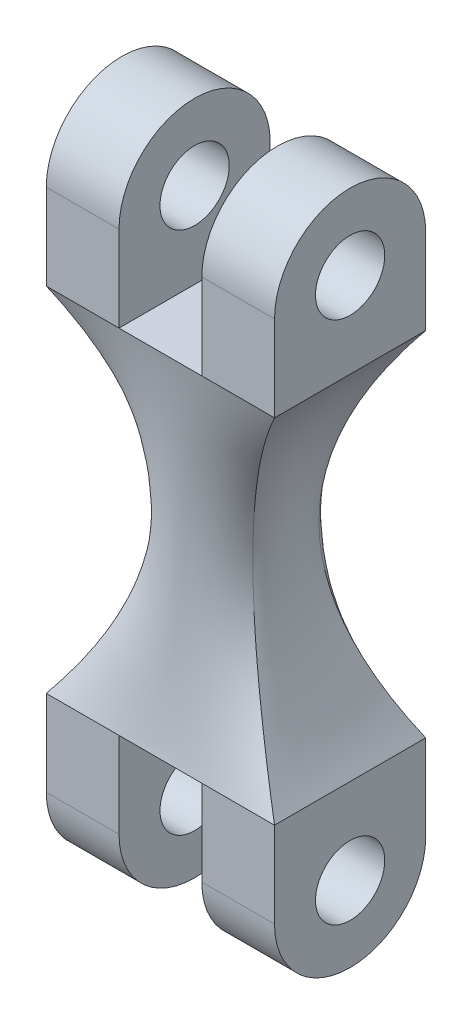
ISO-10303-21;
HEADER;
FILE_DESCRIPTION(('STEP AP214'),'2;1');
FILE_NAME('part.step','',(''),(''),'','','');
FILE_SCHEMA(('AUTOMOTIVE_DESIGN { 1 0 10303 214 1 1 1 1 }'));
ENDSEC;
DATA;
#1=APPLICATION_CONTEXT('core data for automotive mechanical design processes');
#2=APPLICATION_PROTOCOL_DEFINITION('international standard','automotive_design',2000,#1);
#3=PRODUCT_CONTEXT('',#1,'mechanical');
#4=PRODUCT('Part','Part','',(#3));
#5=PRODUCT_RELATED_PRODUCT_CATEGORY('part','',(#4));
#6=PRODUCT_DEFINITION_FORMATION('','',#4);
#7=PRODUCT_DEFINITION_CONTEXT('part definition',#1,'design');
#8=PRODUCT_DEFINITION('design','',#6,#7);
#9=PRODUCT_DEFINITION_SHAPE('','',#8);
#10=(LENGTH_UNIT() NAMED_UNIT(*) SI_UNIT(.MILLI.,.METRE.));
#11=(NAMED_UNIT(*) PLANE_ANGLE_UNIT() SI_UNIT($,.RADIAN.));
#12=(NAMED_UNIT(*) SI_UNIT($,.STERADIAN.) SOLID_ANGLE_UNIT());
#13=UNCERTAINTY_MEASURE_WITH_UNIT(LENGTH_MEASURE(1.E-05),#10,'distance_accuracy_value','');
#14=(GEOMETRIC_REPRESENTATION_CONTEXT(3) GLOBAL_UNCERTAINTY_ASSIGNED_CONTEXT((#13)) GLOBAL_UNIT_ASSIGNED_CONTEXT((#10,
#11,#12)) REPRESENTATION_CONTEXT('',''));
#15=CARTESIAN_POINT('',(0.,0.,0.));
#16=DIRECTION('',(0.,0.,1.));
#17=DIRECTION('',(1.,0.,0.));
#18=AXIS2_PLACEMENT_3D('',#15,#16,#17);
#19=CARTESIAN_POINT('',(0.,0.,0.));
#20=DIRECTION('',(0.,1.,0.));
#21=DIRECTION('',(0.,0.,1.));
#22=AXIS2_PLACEMENT_3D('',#19,#20,#21);
#23=PLANE('',#22);
#24=DIRECTION('',(-1.,0.,0.));
#25=VECTOR('',#24,1.);
#26=CARTESIAN_POINT('',(-4.529,0.,-3.));
#27=LINE('',#26,#25);
#28=CARTESIAN_POINT('',(1.643,0.,-3.));
#29=VERTEX_POINT('',#28);
#30=CARTESIAN_POINT('',(-1.643,0.,-3.));
#31=VERTEX_POINT('',#30);
#32=EDGE_CURVE('E444',#29,#31,#27,.T.);
#33=ORIENTED_EDGE('',*,*,#32,.F.);
#34=DIRECTION('',(0.,0.,1.));
#35=VECTOR('',#34,1.);
#36=CARTESIAN_POINT('',(1.643,0.,3.));
#37=LINE('',#36,#35);
#38=CARTESIAN_POINT('',(1.643,0.,3.));
#39=VERTEX_POINT('',#38);
#40=EDGE_CURVE('E700',#29,#39,#37,.T.);
#41=ORIENTED_EDGE('',*,*,#40,.T.);
#42=DIRECTION('',(1.,0.,0.));
#43=VECTOR('',#42,1.);
#44=CARTESIAN_POINT('',(-4.529,0.,3.));
#45=LINE('',#44,#43);
#46=CARTESIAN_POINT('',(-1.643,0.,3.));
#47=VERTEX_POINT('',#46);
#48=EDGE_CURVE('E331',#47,#39,#45,.T.);
#49=ORIENTED_EDGE('',*,*,#48,.F.);
#50=DIRECTION('',(0.,0.,1.));
#51=VECTOR('',#50,1.);
#52=CARTESIAN_POINT('',(-1.643,0.,3.));
#53=LINE('',#52,#51);
#54=EDGE_CURVE('E389',#31,#47,#53,.T.);
#55=ORIENTED_EDGE('',*,*,#54,.F.);
#56=EDGE_LOOP('',(#33,#41,#49,#55));
#57=FACE_BOUND('',#56,.T.);
#58=ADVANCED_FACE('F77',(#57),#23,.F.);
#59=CARTESIAN_POINT('',(0.,14.,0.));
#60=DIRECTION('',(0.,-1.,0.));
#61=DIRECTION('',(0.,0.,-1.));
#62=AXIS2_PLACEMENT_3D('',#59,#60,#61);
#63=PLANE('',#62);
#64=DIRECTION('',(1.,0.,0.));
#65=VECTOR('',#64,1.);
#66=CARTESIAN_POINT('',(-4.529,14.,3.));
#67=LINE('',#66,#65);
#68=CARTESIAN_POINT('',(-1.643,14.,3.));
#69=VERTEX_POINT('',#68);
#70=CARTESIAN_POINT('',(1.643,14.,3.));
#71=VERTEX_POINT('',#70);
#72=EDGE_CURVE('E87',#69,#71,#67,.T.);
#73=ORIENTED_EDGE('',*,*,#72,.T.);
#74=DIRECTION('',(0.,0.,1.));
#75=VECTOR('',#74,1.);
#76=CARTESIAN_POINT('',(1.643,14.,3.));
#77=LINE('',#76,#75);
#78=CARTESIAN_POINT('',(1.643,14.,-3.));
#79=VERTEX_POINT('',#78);
#80=EDGE_CURVE('E209',#79,#71,#77,.T.);
#81=ORIENTED_EDGE('',*,*,#80,.F.);
#82=DIRECTION('',(-1.,0.,0.));
#83=VECTOR('',#82,1.);
#84=CARTESIAN_POINT('',(-4.529,14.,-3.));
#85=LINE('',#84,#83);
#86=CARTESIAN_POINT('',(-1.643,14.,-3.));
#87=VERTEX_POINT('',#86);
#88=EDGE_CURVE('E324',#79,#87,#85,.T.);
#89=ORIENTED_EDGE('',*,*,#88,.T.);
#90=DIRECTION('',(0.,0.,1.));
#91=VECTOR('',#90,1.);
#92=CARTESIAN_POINT('',(-1.643,14.,3.));
#93=LINE('',#92,#91);
#94=EDGE_CURVE('E246',#87,#69,#93,.T.);
#95=ORIENTED_EDGE('',*,*,#94,.T.);
#96=EDGE_LOOP('',(#73,#81,#89,#95));
#97=FACE_BOUND('',#96,.T.);
#98=ADVANCED_FACE('F79',(#97),#63,.F.);
#99=CARTESIAN_POINT('',(-4.529,0.,3.));
#100=CARTESIAN_POINT('',(-2.82967454845478,2.33333333333333,1.87437042291109));
#101=CARTESIAN_POINT('',(-1.13034909690955,7.,0.748740845822179));
#102=CARTESIAN_POINT('',(-2.82967454845478,11.6666666666667,1.87437042291109));
#103=CARTESIAN_POINT('',(-4.529,14.,3.));
#104=CARTESIAN_POINT('',(-4.15158333333333,0.,3.));
#105=CARTESIAN_POINT('',(-2.62298451265422,2.33333333333333,1.97864445794214));
#106=CARTESIAN_POINT('',(-1.11711278216476,6.99999999999999,0.976482291331089));
#107=CARTESIAN_POINT('',(-2.62298451265422,11.6666666666667,1.97864445794214));
#108=CARTESIAN_POINT('',(-4.15158333333333,14.,3.));
#109=CARTESIAN_POINT('',(-3.39675,0.,3.));
#110=CARTESIAN_POINT('',(-2.20960444105311,2.33333333333334,2.18719252800423));
#111=CARTESIAN_POINT('',(-1.01223163115228,7.00000000000002,1.36566080837681));
#112=CARTESIAN_POINT('',(-2.20960444105311,11.6666666666667,2.18719252800423));
#113=CARTESIAN_POINT('',(-3.39675,14.,3.));
#114=CARTESIAN_POINT('',(-1.88708333333333,0.,3.));
#115=CARTESIAN_POINT('',(-1.27993394314497,2.33333333333333,2.48170910900993));
#116=CARTESIAN_POINT('',(-0.678466627347055,6.99999999999998,1.96865270528451));
#117=CARTESIAN_POINT('',(-1.27993394314497,11.6666666666667,2.48170910900993));
#118=CARTESIAN_POINT('',(-1.88708333333333,14.,3.));
#119=CARTESIAN_POINT('',(0.,0.,3.));
#120=CARTESIAN_POINT('',(8.36980925779145E-05,2.33333333333334,2.65150795100174));
#121=CARTESIAN_POINT('',(0.000169810929422209,7.00000000000002,2.29952675477991));
#122=CARTESIAN_POINT('',(8.36980925769723E-05,11.6666666666667,2.65150795100173));
#123=CARTESIAN_POINT('',(0.,14.,3.));
#124=CARTESIAN_POINT('',(1.88708333333333,0.,3.));
#125=CARTESIAN_POINT('',(1.27977178462595,2.33333333333333,2.48175153838506));
#126=CARTESIAN_POINT('',(0.678135066076207,6.99999999999999,1.96873603117617));
#127=CARTESIAN_POINT('',(1.27977178462595,11.6666666666667,2.48175153838506));
#128=CARTESIAN_POINT('',(1.88708333333333,14.,3.));
#129=CARTESIAN_POINT('',(3.39675,0.,3.));
#130=CARTESIAN_POINT('',(2.20963100324003,2.33333333333333,2.18719865943864));
#131=CARTESIAN_POINT('',(1.01229682924744,7.,1.36567583039112));
#132=CARTESIAN_POINT('',(2.20963100324003,11.6666666666667,2.18719865943864));
#133=CARTESIAN_POINT('',(3.39675,14.,3.));
#134=CARTESIAN_POINT('',(4.15158333333333,0.,3.));
#135=CARTESIAN_POINT('',(2.62299336671653,2.33333333333333,1.97864650175361));
#136=CARTESIAN_POINT('',(1.11710392810245,7.,0.976480247519621));
#137=CARTESIAN_POINT('',(2.62299336671652,11.6666666666667,1.97864650175361));
#138=CARTESIAN_POINT('',(4.15158333333333,14.,3.));
#139=CARTESIAN_POINT('',(4.529,0.,3.));
#140=CARTESIAN_POINT('',(2.82967454845477,2.33333333333333,1.87437042291109));
#141=CARTESIAN_POINT('',(1.13034909690955,7.,0.748740845822179));
#142=CARTESIAN_POINT('',(2.82967454845477,11.6666666666667,1.87437042291109));
#143=CARTESIAN_POINT('',(4.529,14.,3.));
#144=B_SPLINE_SURFACE_WITH_KNOTS('',3,3,((#99,#100,#101,#102,#103),(#104,#105,#106,#107,#108),
(#109,#110,#111,#112,#113),(#114,#115,#116,#117,#118),(#119,#120,#121,#122,#123),(#124,#125,
#126,#127,#128),(#129,#130,#131,#132,#133),(#134,#135,#136,#137,#138),(#139,#140,#141,#142,
#143)),.UNSPECIFIED.,.F.,.F.,.F.,(4,1,1,1,1,1,4),(4,1,4),(0.,0.125,0.25,0.5,0.75,0.875,1.),(0.,
0.5,1.),.UNSPECIFIED.);
#145=CARTESIAN_POINT('',(-4.529,0.,3.));
#146=VERTEX_POINT('',#145);
#147=EDGE_CURVE('E445',#146,#47,#45,.T.);
#148=DIRECTION('',(1.,0.,0.));
#149=VECTOR('',#148,1.);
#150=CARTESIAN_POINT('',(1.643,0.,3.));
#151=LINE('',#150,#149);
#152=CARTESIAN_POINT('',(4.529,0.,3.));
#153=VERTEX_POINT('',#152);
#154=EDGE_CURVE('E527',#39,#153,#151,.T.);
#155=CARTESIAN_POINT('',(4.529,0.,3.));
#156=CARTESIAN_POINT('',(2.82967454845477,2.33333333333333,1.87437042291109));
#157=CARTESIAN_POINT('',(1.13034909690955,7.,0.748740845822179));
#158=CARTESIAN_POINT('',(2.82967454845477,11.6666666666667,1.87437042291109));
#159=CARTESIAN_POINT('',(4.529,14.,3.));
#160=B_SPLINE_CURVE_WITH_KNOTS('',3,(#155,#156,#157,#158,#159),.UNSPECIFIED.,.F.,.F.,(4,1,4),
(0.,0.5,1.),.UNSPECIFIED.);
#161=CARTESIAN_POINT('',(4.529,14.,3.));
#162=VERTEX_POINT('',#161);
#163=EDGE_CURVE('E536',#153,#162,#160,.T.);
#164=DIRECTION('',(1.,0.,0.));
#165=VECTOR('',#164,1.);
#166=CARTESIAN_POINT('',(1.643,14.,3.));
#167=LINE('',#166,#165);
#168=EDGE_CURVE('E95',#71,#162,#167,.T.);
#169=CARTESIAN_POINT('',(-4.529,14.,3.));
#170=VERTEX_POINT('',#169);
#171=EDGE_CURVE('E12',#170,#69,#67,.T.);
#172=CARTESIAN_POINT('',(-4.529,0.,3.));
#173=CARTESIAN_POINT('',(-2.82967454845478,2.33333333333333,1.87437042291109));
#174=CARTESIAN_POINT('',(-1.13034909690955,7.,0.748740845822179));
#175=CARTESIAN_POINT('',(-2.82967454845478,11.6666666666667,1.87437042291109));
#176=CARTESIAN_POINT('',(-4.529,14.,3.));
#177=B_SPLINE_CURVE_WITH_KNOTS('',3,(#172,#173,#174,#175,#176),.UNSPECIFIED.,.F.,.F.,(4,1,4),
(0.,0.5,1.),.UNSPECIFIED.);
#178=EDGE_CURVE('E617',#170,#146,#177,.F.);
#179=ORIENTED_EDGE('',*,*,#147,.T.);
#180=ORIENTED_EDGE('',*,*,#48,.T.);
#181=ORIENTED_EDGE('',*,*,#154,.T.);
#182=ORIENTED_EDGE('',*,*,#163,.T.);
#183=ORIENTED_EDGE('',*,*,#168,.F.);
#184=ORIENTED_EDGE('',*,*,#72,.F.);
#185=ORIENTED_EDGE('',*,*,#171,.F.);
#186=ORIENTED_EDGE('',*,*,#178,.T.);
#187=EDGE_LOOP('',(#179,#180,#181,#182,#183,#184,#185,#186));
#188=FACE_BOUND('',#187,.T.);
#189=ADVANCED_FACE('F505',(#188),#144,.T.);
#190=CARTESIAN_POINT('',(4.529,0.,3.));
#191=CARTESIAN_POINT('',(2.82967454845478,2.33333333333333,1.87437042291109));
#192=CARTESIAN_POINT('',(1.13034909690955,7.,0.748740845822178));
#193=CARTESIAN_POINT('',(2.82967454845477,11.6666666666667,1.87437042291109));
#194=CARTESIAN_POINT('',(4.529,14.,3.));
#195=CARTESIAN_POINT('',(4.529,0.,1.));
#196=CARTESIAN_POINT('',(2.82967454845477,2.33333333333333,0.624790140970363));
#197=CARTESIAN_POINT('',(2.18342179018679,7.,0.40853238514536));
#198=CARTESIAN_POINT('',(2.82967454845477,11.6666666666667,0.624790140970363));
#199=CARTESIAN_POINT('',(4.529,14.,1.));
#200=CARTESIAN_POINT('',(4.529,0.,-1.));
#201=CARTESIAN_POINT('',(2.82967454845477,2.33333333333333,-0.624790140970363));
#202=CARTESIAN_POINT('',(2.18342179018679,7.,-0.40853238514536));
#203=CARTESIAN_POINT('',(2.82967454845477,11.6666666666667,-0.624790140970363));
#204=CARTESIAN_POINT('',(4.529,14.,-1.));
#205=CARTESIAN_POINT('',(4.529,0.,-3.));
#206=CARTESIAN_POINT('',(2.82967454845477,2.33333333333333,-1.87437042291109));
#207=CARTESIAN_POINT('',(1.13034909690955,7.,-0.748740845822179));
#208=CARTESIAN_POINT('',(2.82967454845478,11.6666666666667,-1.87437042291109));
#209=CARTESIAN_POINT('',(4.529,14.,-3.));
#210=B_SPLINE_SURFACE_WITH_KNOTS('',3,3,((#190,#191,#192,#193,#194),(#195,#196,#197,#198,#199),
(#200,#201,#202,#203,#204),(#205,#206,#207,#208,#209)),.UNSPECIFIED.,.F.,.F.,.F.,(4,4),(4,1,4),
(0.,1.),(0.,0.5,1.),.UNSPECIFIED.);
#211=DIRECTION('',(0.,0.,-1.));
#212=VECTOR('',#211,1.);
#213=CARTESIAN_POINT('',(4.529,0.,-3.));
#214=LINE('',#213,#212);
#215=CARTESIAN_POINT('',(4.529,0.,-3.));
#216=VERTEX_POINT('',#215);
#217=EDGE_CURVE('E410',#153,#216,#214,.T.);
#218=CARTESIAN_POINT('',(4.529,0.,-3.));
#219=CARTESIAN_POINT('',(2.82967454845477,2.33333333333333,-1.87437042291109));
#220=CARTESIAN_POINT('',(1.13034909690955,7.,-0.748740845822179));
#221=CARTESIAN_POINT('',(2.82967454845478,11.6666666666667,-1.87437042291109));
#222=CARTESIAN_POINT('',(4.529,14.,-3.));
#223=B_SPLINE_CURVE_WITH_KNOTS('',3,(#218,#219,#220,#221,#222),.UNSPECIFIED.,.F.,.F.,(4,1,4),
(0.,0.5,1.),.UNSPECIFIED.);
#224=CARTESIAN_POINT('',(4.529,14.,-3.));
#225=VERTEX_POINT('',#224);
#226=EDGE_CURVE('E371',#216,#225,#223,.T.);
#227=DIRECTION('',(0.,0.,-1.));
#228=VECTOR('',#227,1.);
#229=CARTESIAN_POINT('',(4.529,14.,3.));
#230=LINE('',#229,#228);
#231=EDGE_CURVE('E576',#162,#225,#230,.T.);
#232=ORIENTED_EDGE('',*,*,#217,.T.);
#233=ORIENTED_EDGE('',*,*,#226,.T.);
#234=ORIENTED_EDGE('',*,*,#231,.F.);
#235=ORIENTED_EDGE('',*,*,#163,.F.);
#236=EDGE_LOOP('',(#232,#233,#234,#235));
#237=FACE_BOUND('',#236,.T.);
#238=ADVANCED_FACE('F579',(#237),#210,.T.);
#239=CARTESIAN_POINT('',(-4.529,0.,-3.));
#240=CARTESIAN_POINT('',(-2.82967454845478,2.33333333333333,-1.87437042291109));
#241=CARTESIAN_POINT('',(-1.13034909690955,7.,-0.748740845822179));
#242=CARTESIAN_POINT('',(-2.82967454845477,11.6666666666667,-1.87437042291109));
#243=CARTESIAN_POINT('',(-4.529,14.,-3.));
#244=CARTESIAN_POINT('',(-4.529,0.,-1.));
#245=CARTESIAN_POINT('',(-2.82967454845477,2.33333333333333,-0.624790140970363));
#246=CARTESIAN_POINT('',(-2.18342179018679,7.,-0.40853238514536));
#247=CARTESIAN_POINT('',(-2.82967454845477,11.6666666666667,-0.624790140970363));
#248=CARTESIAN_POINT('',(-4.529,14.,-1.));
#249=CARTESIAN_POINT('',(-4.529,0.,1.));
#250=CARTESIAN_POINT('',(-2.82967454845477,2.33333333333333,0.624790140970363));
#251=CARTESIAN_POINT('',(-2.18342179018679,7.,0.408532385145359));
#252=CARTESIAN_POINT('',(-2.82967454845477,11.6666666666667,0.624790140970363));
#253=CARTESIAN_POINT('',(-4.529,14.,1.));
#254=CARTESIAN_POINT('',(-4.529,0.,3.));
#255=CARTESIAN_POINT('',(-2.82967454845477,2.33333333333333,1.87437042291109));
#256=CARTESIAN_POINT('',(-1.13034909690955,7.,0.748740845822178));
#257=CARTESIAN_POINT('',(-2.82967454845478,11.6666666666667,1.87437042291109));
#258=CARTESIAN_POINT('',(-4.529,14.,3.));
#259=B_SPLINE_SURFACE_WITH_KNOTS('',3,3,((#239,#240,#241,#242,#243),(#244,#245,#246,#247,#248),
(#249,#250,#251,#252,#253),(#254,#255,#256,#257,#258)),.UNSPECIFIED.,.F.,.F.,.F.,(4,4),(4,1,4),
(0.,1.),(0.,0.5,1.),.UNSPECIFIED.);
#260=DIRECTION('',(0.,0.,1.));
#261=VECTOR('',#260,1.);
#262=CARTESIAN_POINT('',(-4.529,0.,-3.));
#263=LINE('',#262,#261);
#264=CARTESIAN_POINT('',(-4.529,0.,-3.));
#265=VERTEX_POINT('',#264);
#266=EDGE_CURVE('E437',#265,#146,#263,.T.);
#267=DIRECTION('',(0.,0.,1.));
#268=VECTOR('',#267,1.);
#269=CARTESIAN_POINT('',(-4.529,14.,3.));
#270=LINE('',#269,#268);
#271=CARTESIAN_POINT('',(-4.529,14.,-3.));
#272=VERTEX_POINT('',#271);
#273=EDGE_CURVE('E273',#272,#170,#270,.T.);
#274=CARTESIAN_POINT('',(-4.529,0.,-3.));
#275=CARTESIAN_POINT('',(-2.82967454845478,2.33333333333333,-1.87437042291109));
#276=CARTESIAN_POINT('',(-1.13034909690955,7.,-0.748740845822178));
#277=CARTESIAN_POINT('',(-2.82967454845478,11.6666666666667,-1.87437042291109));
#278=CARTESIAN_POINT('',(-4.529,14.,-3.));
#279=B_SPLINE_CURVE_WITH_KNOTS('',3,(#274,#275,#276,#277,#278),.UNSPECIFIED.,.F.,.F.,(4,1,4),
(0.,0.5,1.),.UNSPECIFIED.);
#280=EDGE_CURVE('E328',#265,#272,#279,.T.);
#281=ORIENTED_EDGE('',*,*,#266,.T.);
#282=ORIENTED_EDGE('',*,*,#178,.F.);
#283=ORIENTED_EDGE('',*,*,#273,.F.);
#284=ORIENTED_EDGE('',*,*,#280,.F.);
#285=EDGE_LOOP('',(#281,#282,#283,#284));
#286=FACE_BOUND('',#285,.T.);
#287=ADVANCED_FACE('F354',(#286),#259,.T.);
#288=CARTESIAN_POINT('',(4.529,0.,-3.));
#289=CARTESIAN_POINT('',(2.82967454845477,2.33333333333333,-1.87437042291109));
#290=CARTESIAN_POINT('',(1.13034909690955,7.,-0.748740845822179));
#291=CARTESIAN_POINT('',(2.82967454845478,11.6666666666667,-1.87437042291109));
#292=CARTESIAN_POINT('',(4.529,14.,-3.));
#293=CARTESIAN_POINT('',(4.15158333333333,0.,-3.));
#294=CARTESIAN_POINT('',(2.62298451265422,2.33333333333333,-1.97864445794214));
#295=CARTESIAN_POINT('',(1.11711278216476,7.,-0.97648229133109));
#296=CARTESIAN_POINT('',(2.62298451265422,11.6666666666667,-1.97864445794214));
#297=CARTESIAN_POINT('',(4.15158333333333,14.,-3.));
#298=CARTESIAN_POINT('',(3.39675,0.,-3.));
#299=CARTESIAN_POINT('',(2.20960444105311,2.33333333333333,-2.18719252800423));
#300=CARTESIAN_POINT('',(1.01223163115228,7.,-1.36566080837681));
#301=CARTESIAN_POINT('',(2.20960444105312,11.6666666666667,-2.18719252800423));
#302=CARTESIAN_POINT('',(3.39675,14.,-3.));
#303=CARTESIAN_POINT('',(1.88708333333333,0.,-3.));
#304=CARTESIAN_POINT('',(1.27993394314497,2.33333333333333,-2.48170910900993));
#305=CARTESIAN_POINT('',(0.678466627347055,7.,-1.96865270528451));
#306=CARTESIAN_POINT('',(1.27993394314497,11.6666666666667,-2.48170910900993));
#307=CARTESIAN_POINT('',(1.88708333333333,14.,-3.));
#308=CARTESIAN_POINT('',(0.,0.,-3.));
#309=CARTESIAN_POINT('',(-8.36980925789987E-05,2.33333333333333,-2.65150795100174));
#310=CARTESIAN_POINT('',(-0.000169810929420441,7.,-2.29952675477991));
#311=CARTESIAN_POINT('',(-8.36980925750879E-05,11.6666666666667,-2.65150795100174));
#312=CARTESIAN_POINT('',(0.,14.,-3.));
#313=CARTESIAN_POINT('',(-1.88708333333333,0.,-3.));
#314=CARTESIAN_POINT('',(-1.27977178462594,2.33333333333333,-2.48175153838506));
#315=CARTESIAN_POINT('',(-0.678135066076209,7.,-1.96873603117617));
#316=CARTESIAN_POINT('',(-1.27977178462595,11.6666666666667,-2.48175153838506));
#317=CARTESIAN_POINT('',(-1.88708333333333,14.,-3.));
#318=CARTESIAN_POINT('',(-3.39675,0.,-3.));
#319=CARTESIAN_POINT('',(-2.20963100324003,2.33333333333333,-2.18719865943864));
#320=CARTESIAN_POINT('',(-1.01229682924744,6.99999999999999,-1.36567583039112));
#321=CARTESIAN_POINT('',(-2.20963100324003,11.6666666666667,-2.18719865943864));
#322=CARTESIAN_POINT('',(-3.39675,14.,-3.));
#323=CARTESIAN_POINT('',(-4.15158333333333,0.,-3.));
#324=CARTESIAN_POINT('',(-2.62299336671653,2.33333333333333,-1.97864650175361));
#325=CARTESIAN_POINT('',(-1.11710392810245,7.,-0.976480247519619));
#326=CARTESIAN_POINT('',(-2.62299336671653,11.6666666666667,-1.97864650175361));
#327=CARTESIAN_POINT('',(-4.15158333333333,14.,-3.));
#328=CARTESIAN_POINT('',(-4.529,0.,-3.));
#329=CARTESIAN_POINT('',(-2.82967454845478,2.33333333333333,-1.87437042291109));
#330=CARTESIAN_POINT('',(-1.13034909690955,7.,-0.748740845822178));
#331=CARTESIAN_POINT('',(-2.82967454845478,11.6666666666667,-1.87437042291109));
#332=CARTESIAN_POINT('',(-4.529,14.,-3.));
#333=B_SPLINE_SURFACE_WITH_KNOTS('',3,3,((#288,#289,#290,#291,#292),(#293,#294,#295,#296,#297),
(#298,#299,#300,#301,#302),(#303,#304,#305,#306,#307),(#308,#309,#310,#311,#312),(#313,#314,
#315,#316,#317),(#318,#319,#320,#321,#322),(#323,#324,#325,#326,#327),(#328,#329,#330,#331,
#332)),.UNSPECIFIED.,.F.,.F.,.F.,(4,1,1,1,1,1,4),(4,1,4),(0.,0.125,0.25,0.5,0.75,0.875,1.),(0.,
0.5,1.),.UNSPECIFIED.);
#334=EDGE_CURVE('E615',#216,#29,#27,.T.);
#335=DIRECTION('',(-1.,0.,0.));
#336=VECTOR('',#335,1.);
#337=CARTESIAN_POINT('',(-1.643,0.,-3.));
#338=LINE('',#337,#336);
#339=EDGE_CURVE('E385',#31,#265,#338,.T.);
#340=DIRECTION('',(-1.,0.,0.));
#341=VECTOR('',#340,1.);
#342=CARTESIAN_POINT('',(-1.643,14.,-3.));
#343=LINE('',#342,#341);
#344=EDGE_CURVE('E260',#87,#272,#343,.T.);
#345=EDGE_CURVE('E205',#225,#79,#85,.T.);
#346=ORIENTED_EDGE('',*,*,#334,.T.);
#347=ORIENTED_EDGE('',*,*,#32,.T.);
#348=ORIENTED_EDGE('',*,*,#339,.T.);
#349=ORIENTED_EDGE('',*,*,#280,.T.);
#350=ORIENTED_EDGE('',*,*,#344,.F.);
#351=ORIENTED_EDGE('',*,*,#88,.F.);
#352=ORIENTED_EDGE('',*,*,#345,.F.);
#353=ORIENTED_EDGE('',*,*,#226,.F.);
#354=EDGE_LOOP('',(#346,#347,#348,#349,#350,#351,#352,#353));
#355=FACE_BOUND('',#354,.T.);
#356=ADVANCED_FACE('F323',(#355),#333,.T.);
#357=CARTESIAN_POINT('',(-1.643,-3.4,0.));
#358=DIRECTION('',(1.,0.,0.));
#359=DIRECTION('',(0.,0.,-1.));
#360=AXIS2_PLACEMENT_3D('',#357,#358,#359);
#361=PLANE('',#360);
#362=CARTESIAN_POINT('',(-1.643,-3.4,0.));
#363=DIRECTION('',(1.,0.,0.));
#364=DIRECTION('',(0.,0.,-1.));
#365=AXIS2_PLACEMENT_3D('',#362,#363,#364);
#366=CIRCLE('',#365,3.);
#367=CARTESIAN_POINT('',(-1.643,-3.4,3.));
#368=VERTEX_POINT('',#367);
#369=CARTESIAN_POINT('',(-1.643,-3.4,-3.));
#370=VERTEX_POINT('',#369);
#371=EDGE_CURVE('E399',#368,#370,#366,.T.);
#372=ORIENTED_EDGE('',*,*,#371,.T.);
#373=DIRECTION('',(0.,1.,0.));
#374=VECTOR('',#373,1.);
#375=CARTESIAN_POINT('',(-1.643,-3.4,-3.));
#376=LINE('',#375,#374);
#377=EDGE_CURVE('E394',#370,#31,#376,.T.);
#378=ORIENTED_EDGE('',*,*,#377,.T.);
#379=ORIENTED_EDGE('',*,*,#54,.T.);
#380=DIRECTION('',(0.,-1.,0.));
#381=VECTOR('',#380,1.);
#382=CARTESIAN_POINT('',(-1.643,-3.4,3.));
#383=LINE('',#382,#381);
#384=EDGE_CURVE('E393',#47,#368,#383,.T.);
#385=ORIENTED_EDGE('',*,*,#384,.T.);
#386=EDGE_LOOP('',(#372,#378,#379,#385));
#387=FACE_BOUND('',#386,.T.);
#388=CARTESIAN_POINT('',(-1.643,-3.4,0.));
#389=DIRECTION('',(1.,0.,0.));
#390=DIRECTION('',(0.,0.,-1.));
#391=AXIS2_PLACEMENT_3D('',#388,#389,#390);
#392=CIRCLE('',#391,1.375);
#393=CARTESIAN_POINT('',(-1.643,-3.4,-1.375));
#394=VERTEX_POINT('',#393);
#395=EDGE_CURVE('E405',#394,#394,#392,.T.);
#396=ORIENTED_EDGE('',*,*,#395,.F.);
#397=EDGE_LOOP('',(#396));
#398=FACE_BOUND('',#397,.T.);
#399=ADVANCED_FACE('F353',(#387,#398),#361,.T.);
#400=CARTESIAN_POINT('',(-4.529,-3.4,0.));
#401=DIRECTION('',(1.,0.,0.));
#402=DIRECTION('',(0.,0.,-1.));
#403=AXIS2_PLACEMENT_3D('',#400,#401,#402);
#404=PLANE('',#403);
#405=CARTESIAN_POINT('',(-4.529,-3.4,0.));
#406=DIRECTION('',(1.,0.,0.));
#407=DIRECTION('',(0.,0.,-1.));
#408=AXIS2_PLACEMENT_3D('',#405,#406,#407);
#409=CIRCLE('',#408,3.);
#410=CARTESIAN_POINT('',(-4.529,-3.4,3.));
#411=VERTEX_POINT('',#410);
#412=CARTESIAN_POINT('',(-4.529,-3.4,-3.));
#413=VERTEX_POINT('',#412);
#414=EDGE_CURVE('E401',#411,#413,#409,.T.);
#415=ORIENTED_EDGE('',*,*,#414,.F.);
#416=DIRECTION('',(0.,-1.,0.));
#417=VECTOR('',#416,1.);
#418=CARTESIAN_POINT('',(-4.529,-3.4,3.));
#419=LINE('',#418,#417);
#420=EDGE_CURVE('E435',#146,#411,#419,.T.);
#421=ORIENTED_EDGE('',*,*,#420,.F.);
#422=ORIENTED_EDGE('',*,*,#266,.F.);
#423=DIRECTION('',(0.,1.,0.));
#424=VECTOR('',#423,1.);
#425=CARTESIAN_POINT('',(-4.529,-3.4,-3.));
#426=LINE('',#425,#424);
#427=EDGE_CURVE('E404',#413,#265,#426,.T.);
#428=ORIENTED_EDGE('',*,*,#427,.F.);
#429=EDGE_LOOP('',(#415,#421,#422,#428));
#430=FACE_BOUND('',#429,.T.);
#431=CARTESIAN_POINT('',(-4.529,-3.4,0.));
#432=DIRECTION('',(1.,0.,0.));
#433=DIRECTION('',(0.,0.,-1.));
#434=AXIS2_PLACEMENT_3D('',#431,#432,#433);
#435=CIRCLE('',#434,1.375);
#436=CARTESIAN_POINT('',(-4.529,-3.4,-1.375));
#437=VERTEX_POINT('',#436);
#438=EDGE_CURVE('E726',#437,#437,#435,.T.);
#439=ORIENTED_EDGE('',*,*,#438,.T.);
#440=EDGE_LOOP('',(#439));
#441=FACE_BOUND('',#440,.T.);
#442=ADVANCED_FACE('F439',(#430,#441),#404,.F.);
#443=CARTESIAN_POINT('',(-1.643,-3.4,0.));
#444=DIRECTION('',(-1.,0.,0.));
#445=DIRECTION('',(0.,0.,1.));
#446=AXIS2_PLACEMENT_3D('',#443,#444,#445);
#447=CYLINDRICAL_SURFACE('',#446,3.);
#448=ORIENTED_EDGE('',*,*,#414,.T.);
#449=DIRECTION('',(-1.,0.,0.));
#450=VECTOR('',#449,1.);
#451=CARTESIAN_POINT('',(-1.643,-3.4,-3.));
#452=LINE('',#451,#450);
#453=EDGE_CURVE('E408',#370,#413,#452,.T.);
#454=ORIENTED_EDGE('',*,*,#453,.F.);
#455=ORIENTED_EDGE('',*,*,#371,.F.);
#456=DIRECTION('',(-1.,0.,0.));
#457=VECTOR('',#456,1.);
#458=CARTESIAN_POINT('',(-1.643,-3.4,3.));
#459=LINE('',#458,#457);
#460=EDGE_CURVE('E406',#368,#411,#459,.T.);
#461=ORIENTED_EDGE('',*,*,#460,.T.);
#462=EDGE_LOOP('',(#448,#454,#455,#461));
#463=FACE_BOUND('',#462,.T.);
#464=ADVANCED_FACE('F463',(#463),#447,.T.);
#465=CARTESIAN_POINT('',(-1.643,-3.4,-3.));
#466=DIRECTION('',(0.,0.,1.));
#467=DIRECTION('',(1.,0.,0.));
#468=AXIS2_PLACEMENT_3D('',#465,#466,#467);
#469=PLANE('',#468);
#470=ORIENTED_EDGE('',*,*,#427,.T.);
#471=ORIENTED_EDGE('',*,*,#339,.F.);
#472=ORIENTED_EDGE('',*,*,#377,.F.);
#473=ORIENTED_EDGE('',*,*,#453,.T.);
#474=EDGE_LOOP('',(#470,#471,#472,#473));
#475=FACE_BOUND('',#474,.T.);
#476=ADVANCED_FACE('F429',(#475),#469,.F.);
#477=CARTESIAN_POINT('',(-1.643,-3.4,3.));
#478=DIRECTION('',(0.,0.,-1.));
#479=DIRECTION('',(0.,1.,0.));
#480=AXIS2_PLACEMENT_3D('',#477,#478,#479);
#481=PLANE('',#480);
#482=ORIENTED_EDGE('',*,*,#420,.T.);
#483=ORIENTED_EDGE('',*,*,#460,.F.);
#484=ORIENTED_EDGE('',*,*,#384,.F.);
#485=ORIENTED_EDGE('',*,*,#147,.F.);
#486=EDGE_LOOP('',(#482,#483,#484,#485));
#487=FACE_BOUND('',#486,.T.);
#488=ADVANCED_FACE('F465',(#487),#481,.F.);
#489=CARTESIAN_POINT('',(-1.643,-3.4,0.));
#490=DIRECTION('',(-1.,0.,0.));
#491=DIRECTION('',(0.,0.,1.));
#492=AXIS2_PLACEMENT_3D('',#489,#490,#491);
#493=CYLINDRICAL_SURFACE('',#492,1.375);
#494=ORIENTED_EDGE('',*,*,#395,.T.);
#495=EDGE_LOOP('',(#494));
#496=FACE_BOUND('',#495,.T.);
#497=ORIENTED_EDGE('',*,*,#438,.F.);
#498=EDGE_LOOP('',(#497));
#499=FACE_BOUND('',#498,.T.);
#500=ADVANCED_FACE('F468',(#496,#499),#493,.F.);
#501=CARTESIAN_POINT('',(1.643,-3.4,0.));
#502=DIRECTION('',(1.,0.,0.));
#503=DIRECTION('',(0.,0.,-1.));
#504=AXIS2_PLACEMENT_3D('',#501,#502,#503);
#505=CYLINDRICAL_SURFACE('',#504,3.);
#506=CARTESIAN_POINT('',(4.529,-3.4,0.));
#507=DIRECTION('',(1.,0.,0.));
#508=DIRECTION('',(0.,0.,-1.));
#509=AXIS2_PLACEMENT_3D('',#506,#507,#508);
#510=CIRCLE('',#509,3.);
#511=CARTESIAN_POINT('',(4.529,-3.4,3.));
#512=VERTEX_POINT('',#511);
#513=CARTESIAN_POINT('',(4.529,-3.4,-3.));
#514=VERTEX_POINT('',#513);
#515=EDGE_CURVE('E712',#512,#514,#510,.T.);
#516=ORIENTED_EDGE('',*,*,#515,.F.);
#517=DIRECTION('',(1.,0.,0.));
#518=VECTOR('',#517,1.);
#519=CARTESIAN_POINT('',(1.643,-3.4,3.));
#520=LINE('',#519,#518);
#521=CARTESIAN_POINT('',(1.643,-3.4,3.));
#522=VERTEX_POINT('',#521);
#523=EDGE_CURVE('E704',#522,#512,#520,.T.);
#524=ORIENTED_EDGE('',*,*,#523,.F.);
#525=CARTESIAN_POINT('',(1.643,-3.4,0.));
#526=DIRECTION('',(1.,0.,0.));
#527=DIRECTION('',(0.,0.,-1.));
#528=AXIS2_PLACEMENT_3D('',#525,#526,#527);
#529=CIRCLE('',#528,3.);
#530=CARTESIAN_POINT('',(1.643,-3.4,-3.));
#531=VERTEX_POINT('',#530);
#532=EDGE_CURVE('E701',#522,#531,#529,.T.);
#533=ORIENTED_EDGE('',*,*,#532,.T.);
#534=DIRECTION('',(1.,0.,0.));
#535=VECTOR('',#534,1.);
#536=CARTESIAN_POINT('',(1.643,-3.4,-3.));
#537=LINE('',#536,#535);
#538=EDGE_CURVE('E705',#531,#514,#537,.T.);
#539=ORIENTED_EDGE('',*,*,#538,.T.);
#540=EDGE_LOOP('',(#516,#524,#533,#539));
#541=FACE_BOUND('',#540,.T.);
#542=ADVANCED_FACE('F685',(#541),#505,.T.);
#543=CARTESIAN_POINT('',(1.643,-3.4,3.));
#544=DIRECTION('',(0.,0.,1.));
#545=DIRECTION('',(0.,-1.,0.));
#546=AXIS2_PLACEMENT_3D('',#543,#544,#545);
#547=PLANE('',#546);
#548=DIRECTION('',(0.,-1.,0.));
#549=VECTOR('',#548,1.);
#550=CARTESIAN_POINT('',(4.529,-3.4,3.));
#551=LINE('',#550,#549);
#552=EDGE_CURVE('E710',#153,#512,#551,.T.);
#553=ORIENTED_EDGE('',*,*,#552,.F.);
#554=ORIENTED_EDGE('',*,*,#154,.F.);
#555=DIRECTION('',(0.,-1.,0.));
#556=VECTOR('',#555,1.);
#557=CARTESIAN_POINT('',(1.643,-3.4,3.));
#558=LINE('',#557,#556);
#559=EDGE_CURVE('E692',#39,#522,#558,.T.);
#560=ORIENTED_EDGE('',*,*,#559,.T.);
#561=ORIENTED_EDGE('',*,*,#523,.T.);
#562=EDGE_LOOP('',(#553,#554,#560,#561));
#563=FACE_BOUND('',#562,.T.);
#564=ADVANCED_FACE('F678',(#563),#547,.T.);
#565=CARTESIAN_POINT('',(1.643,-3.4,-3.));
#566=DIRECTION('',(0.,0.,-1.));
#567=DIRECTION('',(-1.,0.,0.));
#568=AXIS2_PLACEMENT_3D('',#565,#566,#567);
#569=PLANE('',#568);
#570=DIRECTION('',(0.,1.,0.));
#571=VECTOR('',#570,1.);
#572=CARTESIAN_POINT('',(4.529,-3.4,-3.));
#573=LINE('',#572,#571);
#574=EDGE_CURVE('E666',#514,#216,#573,.T.);
#575=ORIENTED_EDGE('',*,*,#574,.F.);
#576=ORIENTED_EDGE('',*,*,#538,.F.);
#577=DIRECTION('',(0.,1.,0.));
#578=VECTOR('',#577,1.);
#579=CARTESIAN_POINT('',(1.643,-3.4,-3.));
#580=LINE('',#579,#578);
#581=EDGE_CURVE('E529',#531,#29,#580,.T.);
#582=ORIENTED_EDGE('',*,*,#581,.T.);
#583=ORIENTED_EDGE('',*,*,#334,.F.);
#584=EDGE_LOOP('',(#575,#576,#582,#583));
#585=FACE_BOUND('',#584,.T.);
#586=ADVANCED_FACE('F667',(#585),#569,.T.);
#587=CARTESIAN_POINT('',(1.643,-3.4,0.));
#588=DIRECTION('',(-1.,0.,0.));
#589=DIRECTION('',(0.,0.,-1.));
#590=AXIS2_PLACEMENT_3D('',#587,#588,#589);
#591=PLANE('',#590);
#592=CARTESIAN_POINT('',(1.643,-3.4,0.));
#593=DIRECTION('',(1.,0.,0.));
#594=DIRECTION('',(0.,0.,-1.));
#595=AXIS2_PLACEMENT_3D('',#592,#593,#594);
#596=CIRCLE('',#595,1.375);
#597=CARTESIAN_POINT('',(1.643,-3.4,-1.375));
#598=VERTEX_POINT('',#597);
#599=EDGE_CURVE('E715',#598,#598,#596,.T.);
#600=ORIENTED_EDGE('',*,*,#599,.T.);
#601=EDGE_LOOP('',(#600));
#602=FACE_BOUND('',#601,.T.);
#603=ORIENTED_EDGE('',*,*,#532,.F.);
#604=ORIENTED_EDGE('',*,*,#559,.F.);
#605=ORIENTED_EDGE('',*,*,#40,.F.);
#606=ORIENTED_EDGE('',*,*,#581,.F.);
#607=EDGE_LOOP('',(#603,#604,#605,#606));
#608=FACE_BOUND('',#607,.T.);
#609=ADVANCED_FACE('F677',(#602,#608),#591,.T.);
#610=CARTESIAN_POINT('',(4.529,-3.4,0.));
#611=DIRECTION('',(-1.,0.,0.));
#612=DIRECTION('',(0.,0.,-1.));
#613=AXIS2_PLACEMENT_3D('',#610,#611,#612);
#614=PLANE('',#613);
#615=CARTESIAN_POINT('',(4.529,-3.4,0.));
#616=DIRECTION('',(1.,0.,0.));
#617=DIRECTION('',(0.,0.,-1.));
#618=AXIS2_PLACEMENT_3D('',#615,#616,#617);
#619=CIRCLE('',#618,1.375);
#620=CARTESIAN_POINT('',(4.529,-3.4,-1.375));
#621=VERTEX_POINT('',#620);
#622=EDGE_CURVE('E719',#621,#621,#619,.T.);
#623=ORIENTED_EDGE('',*,*,#622,.F.);
#624=EDGE_LOOP('',(#623));
#625=FACE_BOUND('',#624,.T.);
#626=ORIENTED_EDGE('',*,*,#515,.T.);
#627=ORIENTED_EDGE('',*,*,#574,.T.);
#628=ORIENTED_EDGE('',*,*,#217,.F.);
#629=ORIENTED_EDGE('',*,*,#552,.T.);
#630=EDGE_LOOP('',(#626,#627,#628,#629));
#631=FACE_BOUND('',#630,.T.);
#632=ADVANCED_FACE('F679',(#625,#631),#614,.F.);
#633=CARTESIAN_POINT('',(1.643,-3.4,0.));
#634=DIRECTION('',(1.,0.,0.));
#635=DIRECTION('',(0.,0.,-1.));
#636=AXIS2_PLACEMENT_3D('',#633,#634,#635);
#637=CYLINDRICAL_SURFACE('',#636,1.375);
#638=ORIENTED_EDGE('',*,*,#599,.F.);
#639=EDGE_LOOP('',(#638));
#640=FACE_BOUND('',#639,.T.);
#641=ORIENTED_EDGE('',*,*,#622,.T.);
#642=EDGE_LOOP('',(#641));
#643=FACE_BOUND('',#642,.T.);
#644=ADVANCED_FACE('F760',(#640,#643),#637,.F.);
#645=CARTESIAN_POINT('',(-1.643,17.4,0.));
#646=DIRECTION('',(-1.,0.,0.));
#647=DIRECTION('',(0.,0.,1.));
#648=AXIS2_PLACEMENT_3D('',#645,#646,#647);
#649=CYLINDRICAL_SURFACE('',#648,3.);
#650=CARTESIAN_POINT('',(-4.529,17.4,0.));
#651=DIRECTION('',(-1.,0.,0.));
#652=DIRECTION('',(0.,0.,-1.));
#653=AXIS2_PLACEMENT_3D('',#650,#651,#652);
#654=CIRCLE('',#653,3.);
#655=CARTESIAN_POINT('',(-4.529,17.4,3.));
#656=VERTEX_POINT('',#655);
#657=CARTESIAN_POINT('',(-4.529,17.4,-3.));
#658=VERTEX_POINT('',#657);
#659=EDGE_CURVE('E236',#656,#658,#654,.T.);
#660=ORIENTED_EDGE('',*,*,#659,.F.);
#661=DIRECTION('',(-1.,0.,0.));
#662=VECTOR('',#661,1.);
#663=CARTESIAN_POINT('',(-1.643,17.4,3.));
#664=LINE('',#663,#662);
#665=CARTESIAN_POINT('',(-1.643,17.4,3.));
#666=VERTEX_POINT('',#665);
#667=EDGE_CURVE('E263',#666,#656,#664,.T.);
#668=ORIENTED_EDGE('',*,*,#667,.F.);
#669=CARTESIAN_POINT('',(-1.643,17.4,0.));
#670=DIRECTION('',(-1.,0.,0.));
#671=DIRECTION('',(0.,0.,-1.));
#672=AXIS2_PLACEMENT_3D('',#669,#670,#671);
#673=CIRCLE('',#672,3.);
#674=CARTESIAN_POINT('',(-1.643,17.4,-3.));
#675=VERTEX_POINT('',#674);
#676=EDGE_CURVE('E238',#666,#675,#673,.T.);
#677=ORIENTED_EDGE('',*,*,#676,.T.);
#678=DIRECTION('',(-1.,0.,0.));
#679=VECTOR('',#678,1.);
#680=CARTESIAN_POINT('',(-1.643,17.4,-3.));
#681=LINE('',#680,#679);
#682=EDGE_CURVE('E264',#675,#658,#681,.T.);
#683=ORIENTED_EDGE('',*,*,#682,.T.);
#684=EDGE_LOOP('',(#660,#668,#677,#683));
#685=FACE_BOUND('',#684,.T.);
#686=ADVANCED_FACE('F764',(#685),#649,.T.);
#687=CARTESIAN_POINT('',(-1.643,17.4,3.));
#688=DIRECTION('',(0.,0.,1.));
#689=DIRECTION('',(0.,-1.,0.));
#690=AXIS2_PLACEMENT_3D('',#687,#688,#689);
#691=PLANE('',#690);
#692=DIRECTION('',(0.,1.,0.));
#693=VECTOR('',#692,1.);
#694=CARTESIAN_POINT('',(-4.529,17.4,3.));
#695=LINE('',#694,#693);
#696=EDGE_CURVE('E279',#170,#656,#695,.T.);
#697=ORIENTED_EDGE('',*,*,#696,.F.);
#698=ORIENTED_EDGE('',*,*,#171,.T.);
#699=DIRECTION('',(0.,1.,0.));
#700=VECTOR('',#699,1.);
#701=CARTESIAN_POINT('',(-1.643,17.4,3.));
#702=LINE('',#701,#700);
#703=EDGE_CURVE('E104',#69,#666,#702,.T.);
#704=ORIENTED_EDGE('',*,*,#703,.T.);
#705=ORIENTED_EDGE('',*,*,#667,.T.);
#706=EDGE_LOOP('',(#697,#698,#704,#705));
#707=FACE_BOUND('',#706,.T.);
#708=ADVANCED_FACE('F299',(#707),#691,.T.);
#709=CARTESIAN_POINT('',(-1.643,17.4,-3.));
#710=DIRECTION('',(0.,0.,-1.));
#711=DIRECTION('',(-1.,0.,0.));
#712=AXIS2_PLACEMENT_3D('',#709,#710,#711);
#713=PLANE('',#712);
#714=DIRECTION('',(0.,-1.,0.));
#715=VECTOR('',#714,1.);
#716=CARTESIAN_POINT('',(-4.529,17.4,-3.));
#717=LINE('',#716,#715);
#718=EDGE_CURVE('E241',#658,#272,#717,.T.);
#719=ORIENTED_EDGE('',*,*,#718,.F.);
#720=ORIENTED_EDGE('',*,*,#682,.F.);
#721=DIRECTION('',(0.,-1.,0.));
#722=VECTOR('',#721,1.);
#723=CARTESIAN_POINT('',(-1.643,17.4,-3.));
#724=LINE('',#723,#722);
#725=EDGE_CURVE('E250',#675,#87,#724,.T.);
#726=ORIENTED_EDGE('',*,*,#725,.T.);
#727=ORIENTED_EDGE('',*,*,#344,.T.);
#728=EDGE_LOOP('',(#719,#720,#726,#727));
#729=FACE_BOUND('',#728,.T.);
#730=ADVANCED_FACE('F295',(#729),#713,.T.);
#731=CARTESIAN_POINT('',(-1.643,17.4,0.));
#732=DIRECTION('',(1.,0.,0.));
#733=DIRECTION('',(0.,0.,-1.));
#734=AXIS2_PLACEMENT_3D('',#731,#732,#733);
#735=PLANE('',#734);
#736=CARTESIAN_POINT('',(-1.643,17.4,0.));
#737=DIRECTION('',(-1.,0.,0.));
#738=DIRECTION('',(0.,0.,-1.));
#739=AXIS2_PLACEMENT_3D('',#736,#737,#738);
#740=CIRCLE('',#739,1.375);
#741=CARTESIAN_POINT('',(-1.643,17.4,-1.375));
#742=VERTEX_POINT('',#741);
#743=EDGE_CURVE('E228',#742,#742,#740,.T.);
#744=ORIENTED_EDGE('',*,*,#743,.T.);
#745=EDGE_LOOP('',(#744));
#746=FACE_BOUND('',#745,.T.);
#747=ORIENTED_EDGE('',*,*,#676,.F.);
#748=ORIENTED_EDGE('',*,*,#703,.F.);
#749=ORIENTED_EDGE('',*,*,#94,.F.);
#750=ORIENTED_EDGE('',*,*,#725,.F.);
#751=EDGE_LOOP('',(#747,#748,#749,#750));
#752=FACE_BOUND('',#751,.T.);
#753=ADVANCED_FACE('F292',(#746,#752),#735,.T.);
#754=CARTESIAN_POINT('',(-4.529,17.4,0.));
#755=DIRECTION('',(1.,0.,0.));
#756=DIRECTION('',(0.,0.,-1.));
#757=AXIS2_PLACEMENT_3D('',#754,#755,#756);
#758=PLANE('',#757);
#759=CARTESIAN_POINT('',(-4.529,17.4,0.));
#760=DIRECTION('',(-1.,0.,0.));
#761=DIRECTION('',(0.,0.,-1.));
#762=AXIS2_PLACEMENT_3D('',#759,#760,#761);
#763=CIRCLE('',#762,1.375);
#764=CARTESIAN_POINT('',(-4.529,17.4,-1.375));
#765=VERTEX_POINT('',#764);
#766=EDGE_CURVE('E225',#765,#765,#763,.T.);
#767=ORIENTED_EDGE('',*,*,#766,.F.);
#768=EDGE_LOOP('',(#767));
#769=FACE_BOUND('',#768,.T.);
#770=ORIENTED_EDGE('',*,*,#659,.T.);
#771=ORIENTED_EDGE('',*,*,#718,.T.);
#772=ORIENTED_EDGE('',*,*,#273,.T.);
#773=ORIENTED_EDGE('',*,*,#696,.T.);
#774=EDGE_LOOP('',(#770,#771,#772,#773));
#775=FACE_BOUND('',#774,.T.);
#776=ADVANCED_FACE('F281',(#769,#775),#758,.F.);
#777=CARTESIAN_POINT('',(-1.643,17.4,0.));
#778=DIRECTION('',(-1.,0.,0.));
#779=DIRECTION('',(0.,0.,1.));
#780=AXIS2_PLACEMENT_3D('',#777,#778,#779);
#781=CYLINDRICAL_SURFACE('',#780,1.375);
#782=ORIENTED_EDGE('',*,*,#743,.F.);
#783=EDGE_LOOP('',(#782));
#784=FACE_BOUND('',#783,.T.);
#785=ORIENTED_EDGE('',*,*,#766,.T.);
#786=EDGE_LOOP('',(#785));
#787=FACE_BOUND('',#786,.T.);
#788=ADVANCED_FACE('F291',(#784,#787),#781,.F.);
#789=CARTESIAN_POINT('',(1.643,17.4,0.));
#790=DIRECTION('',(-1.,0.,0.));
#791=DIRECTION('',(0.,0.,-1.));
#792=AXIS2_PLACEMENT_3D('',#789,#790,#791);
#793=PLANE('',#792);
#794=CARTESIAN_POINT('',(1.643,17.4,0.));
#795=DIRECTION('',(-1.,0.,0.));
#796=DIRECTION('',(0.,0.,-1.));
#797=AXIS2_PLACEMENT_3D('',#794,#795,#796);
#798=CIRCLE('',#797,3.);
#799=CARTESIAN_POINT('',(1.643,17.4,3.));
#800=VERTEX_POINT('',#799);
#801=CARTESIAN_POINT('',(1.643,17.4,-3.));
#802=VERTEX_POINT('',#801);
#803=EDGE_CURVE('E210',#800,#802,#798,.T.);
#804=ORIENTED_EDGE('',*,*,#803,.T.);
#805=DIRECTION('',(0.,-1.,0.));
#806=VECTOR('',#805,1.);
#807=CARTESIAN_POINT('',(1.643,17.4,-3.));
#808=LINE('',#807,#806);
#809=EDGE_CURVE('E198',#802,#79,#808,.T.);
#810=ORIENTED_EDGE('',*,*,#809,.T.);
#811=ORIENTED_EDGE('',*,*,#80,.T.);
#812=DIRECTION('',(0.,1.,0.));
#813=VECTOR('',#812,1.);
#814=CARTESIAN_POINT('',(1.643,17.4,3.));
#815=LINE('',#814,#813);
#816=EDGE_CURVE('E216',#71,#800,#815,.T.);
#817=ORIENTED_EDGE('',*,*,#816,.T.);
#818=EDGE_LOOP('',(#804,#810,#811,#817));
#819=FACE_BOUND('',#818,.T.);
#820=CARTESIAN_POINT('',(1.643,17.4,0.));
#821=DIRECTION('',(-1.,0.,0.));
#822=DIRECTION('',(0.,0.,-1.));
#823=AXIS2_PLACEMENT_3D('',#820,#821,#822);
#824=CIRCLE('',#823,1.375);
#825=CARTESIAN_POINT('',(1.643,17.4,-1.375));
#826=VERTEX_POINT('',#825);
#827=EDGE_CURVE('E923',#826,#826,#824,.T.);
#828=ORIENTED_EDGE('',*,*,#827,.F.);
#829=EDGE_LOOP('',(#828));
#830=FACE_BOUND('',#829,.T.);
#831=ADVANCED_FACE('F213',(#819,#830),#793,.T.);
#832=CARTESIAN_POINT('',(4.529,17.4,0.));
#833=DIRECTION('',(-1.,0.,0.));
#834=DIRECTION('',(0.,0.,-1.));
#835=AXIS2_PLACEMENT_3D('',#832,#833,#834);
#836=PLANE('',#835);
#837=CARTESIAN_POINT('',(4.529,17.4,0.));
#838=DIRECTION('',(-1.,0.,0.));
#839=DIRECTION('',(0.,0.,-1.));
#840=AXIS2_PLACEMENT_3D('',#837,#838,#839);
#841=CIRCLE('',#840,3.);
#842=CARTESIAN_POINT('',(4.529,17.4,3.));
#843=VERTEX_POINT('',#842);
#844=CARTESIAN_POINT('',(4.529,17.4,-3.));
#845=VERTEX_POINT('',#844);
#846=EDGE_CURVE('E224',#843,#845,#841,.T.);
#847=ORIENTED_EDGE('',*,*,#846,.F.);
#848=DIRECTION('',(0.,1.,0.));
#849=VECTOR('',#848,1.);
#850=CARTESIAN_POINT('',(4.529,17.4,3.));
#851=LINE('',#850,#849);
#852=EDGE_CURVE('E220',#162,#843,#851,.T.);
#853=ORIENTED_EDGE('',*,*,#852,.F.);
#854=ORIENTED_EDGE('',*,*,#231,.T.);
#855=DIRECTION('',(0.,-1.,0.));
#856=VECTOR('',#855,1.);
#857=CARTESIAN_POINT('',(4.529,17.4,-3.));
#858=LINE('',#857,#856);
#859=EDGE_CURVE('E911',#845,#225,#858,.T.);
#860=ORIENTED_EDGE('',*,*,#859,.F.);
#861=EDGE_LOOP('',(#847,#853,#854,#860));
#862=FACE_BOUND('',#861,.T.);
#863=CARTESIAN_POINT('',(4.529,17.4,0.));
#864=DIRECTION('',(-1.,0.,0.));
#865=DIRECTION('',(0.,0.,-1.));
#866=AXIS2_PLACEMENT_3D('',#863,#864,#865);
#867=CIRCLE('',#866,1.375);
#868=CARTESIAN_POINT('',(4.529,17.4,-1.375));
#869=VERTEX_POINT('',#868);
#870=EDGE_CURVE('E924',#869,#869,#867,.T.);
#871=ORIENTED_EDGE('',*,*,#870,.T.);
#872=EDGE_LOOP('',(#871));
#873=FACE_BOUND('',#872,.T.);
#874=ADVANCED_FACE('F804',(#862,#873),#836,.F.);
#875=CARTESIAN_POINT('',(1.643,17.4,0.));
#876=DIRECTION('',(1.,0.,0.));
#877=DIRECTION('',(0.,0.,-1.));
#878=AXIS2_PLACEMENT_3D('',#875,#876,#877);
#879=CYLINDRICAL_SURFACE('',#878,3.);
#880=ORIENTED_EDGE('',*,*,#846,.T.);
#881=DIRECTION('',(1.,0.,0.));
#882=VECTOR('',#881,1.);
#883=CARTESIAN_POINT('',(1.643,17.4,-3.));
#884=LINE('',#883,#882);
#885=EDGE_CURVE('E203',#802,#845,#884,.T.);
#886=ORIENTED_EDGE('',*,*,#885,.F.);
#887=ORIENTED_EDGE('',*,*,#803,.F.);
#888=DIRECTION('',(1.,0.,0.));
#889=VECTOR('',#888,1.);
#890=CARTESIAN_POINT('',(1.643,17.4,3.));
#891=LINE('',#890,#889);
#892=EDGE_CURVE('E230',#800,#843,#891,.T.);
#893=ORIENTED_EDGE('',*,*,#892,.T.);
#894=EDGE_LOOP('',(#880,#886,#887,#893));
#895=FACE_BOUND('',#894,.T.);
#896=ADVANCED_FACE('F222',(#895),#879,.T.);
#897=CARTESIAN_POINT('',(1.643,17.4,-3.));
#898=DIRECTION('',(0.,0.,1.));
#899=DIRECTION('',(1.,0.,0.));
#900=AXIS2_PLACEMENT_3D('',#897,#898,#899);
#901=PLANE('',#900);
#902=ORIENTED_EDGE('',*,*,#859,.T.);
#903=ORIENTED_EDGE('',*,*,#345,.T.);
#904=ORIENTED_EDGE('',*,*,#809,.F.);
#905=ORIENTED_EDGE('',*,*,#885,.T.);
#906=EDGE_LOOP('',(#902,#903,#904,#905));
#907=FACE_BOUND('',#906,.T.);
#908=ADVANCED_FACE('F201',(#907),#901,.F.);
#909=CARTESIAN_POINT('',(1.643,17.4,3.));
#910=DIRECTION('',(0.,0.,-1.));
#911=DIRECTION('',(0.,1.,0.));
#912=AXIS2_PLACEMENT_3D('',#909,#910,#911);
#913=PLANE('',#912);
#914=ORIENTED_EDGE('',*,*,#852,.T.);
#915=ORIENTED_EDGE('',*,*,#892,.F.);
#916=ORIENTED_EDGE('',*,*,#816,.F.);
#917=ORIENTED_EDGE('',*,*,#168,.T.);
#918=EDGE_LOOP('',(#914,#915,#916,#917));
#919=FACE_BOUND('',#918,.T.);
#920=ADVANCED_FACE('F800',(#919),#913,.F.);
#921=CARTESIAN_POINT('',(1.643,17.4,0.));
#922=DIRECTION('',(1.,0.,0.));
#923=DIRECTION('',(0.,0.,-1.));
#924=AXIS2_PLACEMENT_3D('',#921,#922,#923);
#925=CYLINDRICAL_SURFACE('',#924,1.375);
#926=ORIENTED_EDGE('',*,*,#827,.T.);
#927=EDGE_LOOP('',(#926));
#928=FACE_BOUND('',#927,.T.);
#929=ORIENTED_EDGE('',*,*,#870,.F.);
#930=EDGE_LOOP('',(#929));
#931=FACE_BOUND('',#930,.T.);
#932=ADVANCED_FACE('F865',(#928,#931),#925,.F.);
#933=CLOSED_SHELL('',(#58,#98,#189,#238,#287,#356,#399,#442,#464,#476,#488,#500,#542,#564,#586,
#609,#632,#644,#686,#708,#730,#753,#776,#788,#831,#874,#896,#908,#920,#932));
#934=MANIFOLD_SOLID_BREP('B2',#933);
#935=ADVANCED_BREP_SHAPE_REPRESENTATION('',(#18,#934),#14);
#936=SHAPE_DEFINITION_REPRESENTATION(#9,#935);
ENDSEC;
END-ISO-10303-21;
